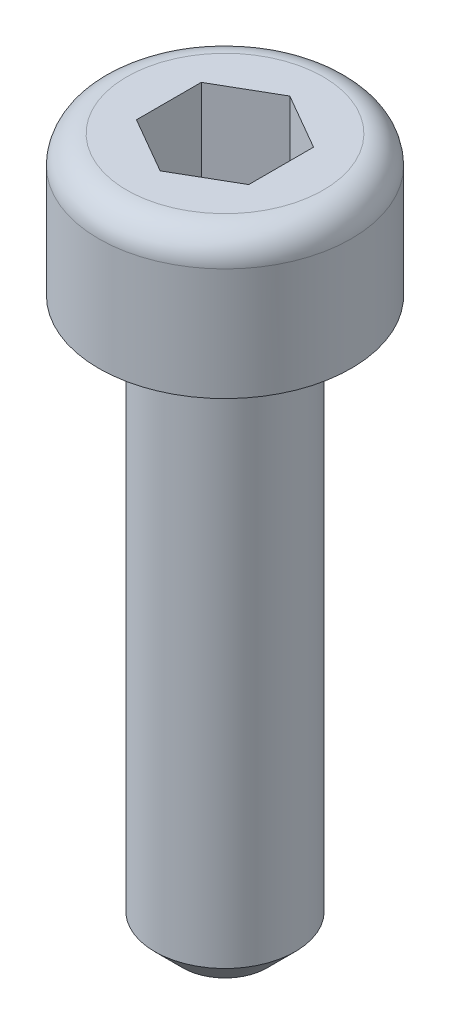
ISO-10303-21;
HEADER;
FILE_DESCRIPTION(('STEP AP214'),'2;1');
FILE_NAME('part.step','',(''),(''),'','','');
FILE_SCHEMA(('AUTOMOTIVE_DESIGN { 1 0 10303 214 1 1 1 1 }'));
ENDSEC;
DATA;
#1=APPLICATION_CONTEXT('core data for automotive mechanical design processes');
#2=APPLICATION_PROTOCOL_DEFINITION('international standard','automotive_design',2000,#1);
#3=PRODUCT_CONTEXT('',#1,'mechanical');
#4=PRODUCT('Part','Part','',(#3));
#5=PRODUCT_RELATED_PRODUCT_CATEGORY('part','',(#4));
#6=PRODUCT_DEFINITION_FORMATION('','',#4);
#7=PRODUCT_DEFINITION_CONTEXT('part definition',#1,'design');
#8=PRODUCT_DEFINITION('design','',#6,#7);
#9=PRODUCT_DEFINITION_SHAPE('','',#8);
#10=(LENGTH_UNIT() NAMED_UNIT(*) SI_UNIT(.MILLI.,.METRE.));
#11=(NAMED_UNIT(*) PLANE_ANGLE_UNIT() SI_UNIT($,.RADIAN.));
#12=(NAMED_UNIT(*) SI_UNIT($,.STERADIAN.) SOLID_ANGLE_UNIT());
#13=UNCERTAINTY_MEASURE_WITH_UNIT(LENGTH_MEASURE(1.E-05),#10,'distance_accuracy_value','');
#14=(GEOMETRIC_REPRESENTATION_CONTEXT(3) GLOBAL_UNCERTAINTY_ASSIGNED_CONTEXT((#13)) GLOBAL_UNIT_ASSIGNED_CONTEXT((#10,
#11,#12)) REPRESENTATION_CONTEXT('',''));
#15=CARTESIAN_POINT('',(0.,0.,0.));
#16=DIRECTION('',(0.,0.,1.));
#17=DIRECTION('',(1.,0.,0.));
#18=AXIS2_PLACEMENT_3D('',#15,#16,#17);
#19=CARTESIAN_POINT('',(0.,0.,0.));
#20=DIRECTION('',(0.,-1.,0.));
#21=DIRECTION('',(0.,0.,-1.));
#22=AXIS2_PLACEMENT_3D('',#19,#20,#21);
#23=PLANE('',#22);
#24=CARTESIAN_POINT('',(0.,0.,0.));
#25=DIRECTION('',(0.,-1.,0.));
#26=DIRECTION('',(0.,0.,-1.));
#27=AXIS2_PLACEMENT_3D('',#24,#25,#26);
#28=CIRCLE('',#27,1.75);
#29=CARTESIAN_POINT('',(0.,0.,-1.75));
#30=VERTEX_POINT('',#29);
#31=EDGE_CURVE('E42',#30,#30,#28,.F.);
#32=ORIENTED_EDGE('',*,*,#31,.T.);
#33=EDGE_LOOP('',(#32));
#34=FACE_BOUND('',#33,.T.);
#35=DIRECTION('',(-0.866025403784439,0.,-0.5));
#36=VECTOR('',#35,1.);
#37=CARTESIAN_POINT('',(1.,0.,-0.577350269189626));
#38=LINE('',#37,#36);
#39=CARTESIAN_POINT('',(1.,0.,-0.577350269189626));
#40=VERTEX_POINT('',#39);
#41=CARTESIAN_POINT('',(0.,0.,-1.15470053837925));
#42=VERTEX_POINT('',#41);
#43=EDGE_CURVE('E123',#40,#42,#38,.T.);
#44=ORIENTED_EDGE('',*,*,#43,.F.);
#45=DIRECTION('',(0.,0.,-1.));
#46=VECTOR('',#45,1.);
#47=CARTESIAN_POINT('',(1.,0.,0.577350269189626));
#48=LINE('',#47,#46);
#49=CARTESIAN_POINT('',(1.,0.,0.577350269189626));
#50=VERTEX_POINT('',#49);
#51=EDGE_CURVE('E49',#50,#40,#48,.T.);
#52=ORIENTED_EDGE('',*,*,#51,.F.);
#53=DIRECTION('',(0.866025403784439,0.,-0.5));
#54=VECTOR('',#53,1.);
#55=CARTESIAN_POINT('',(0.,0.,1.15470053837925));
#56=LINE('',#55,#54);
#57=CARTESIAN_POINT('',(0.,0.,1.15470053837925));
#58=VERTEX_POINT('',#57);
#59=EDGE_CURVE('E132',#58,#50,#56,.T.);
#60=ORIENTED_EDGE('',*,*,#59,.F.);
#61=DIRECTION('',(0.866025403784438,0.,0.5));
#62=VECTOR('',#61,1.);
#63=CARTESIAN_POINT('',(-0.999999999999999,0.,0.577350269189626));
#64=LINE('',#63,#62);
#65=CARTESIAN_POINT('',(-0.999999999999999,0.,0.577350269189626));
#66=VERTEX_POINT('',#65);
#67=EDGE_CURVE('E130',#66,#58,#64,.T.);
#68=ORIENTED_EDGE('',*,*,#67,.F.);
#69=DIRECTION('',(0.,0.,1.));
#70=VECTOR('',#69,1.);
#71=CARTESIAN_POINT('',(-0.999999999999999,0.,-0.577350269189626));
#72=LINE('',#71,#70);
#73=CARTESIAN_POINT('',(-0.999999999999999,0.,-0.577350269189626));
#74=VERTEX_POINT('',#73);
#75=EDGE_CURVE('E97',#74,#66,#72,.T.);
#76=ORIENTED_EDGE('',*,*,#75,.F.);
#77=DIRECTION('',(-0.866025403784439,0.,0.5));
#78=VECTOR('',#77,1.);
#79=CARTESIAN_POINT('',(0.,0.,-1.15470053837925));
#80=LINE('',#79,#78);
#81=EDGE_CURVE('E126',#42,#74,#80,.T.);
#82=ORIENTED_EDGE('',*,*,#81,.F.);
#83=EDGE_LOOP('',(#44,#52,#60,#68,#76,#82));
#84=FACE_BOUND('',#83,.T.);
#85=ADVANCED_FACE('F34',(#34,#84),#23,.F.);
#86=CARTESIAN_POINT('',(0.,0.,0.));
#87=DIRECTION('',(0.,1.,0.));
#88=DIRECTION('',(0.,0.,1.));
#89=AXIS2_PLACEMENT_3D('',#86,#87,#88);
#90=CYLINDRICAL_SURFACE('',#89,2.25);
#91=CARTESIAN_POINT('',(0.,-0.5,0.));
#92=DIRECTION('',(0.,-1.,0.));
#93=DIRECTION('',(0.,0.,-1.));
#94=AXIS2_PLACEMENT_3D('',#91,#92,#93);
#95=CIRCLE('',#94,2.25);
#96=CARTESIAN_POINT('',(0.,-0.5,-2.25));
#97=VERTEX_POINT('',#96);
#98=EDGE_CURVE('E11',#97,#97,#95,.T.);
#99=ORIENTED_EDGE('',*,*,#98,.T.);
#100=EDGE_LOOP('',(#99));
#101=FACE_BOUND('',#100,.T.);
#102=CARTESIAN_POINT('',(0.,-2.5,0.));
#103=DIRECTION('',(0.,1.,0.));
#104=DIRECTION('',(0.,0.,1.));
#105=AXIS2_PLACEMENT_3D('',#102,#103,#104);
#106=CIRCLE('',#105,2.25);
#107=CARTESIAN_POINT('',(0.,-2.5,2.25));
#108=VERTEX_POINT('',#107);
#109=EDGE_CURVE('E144',#108,#108,#106,.T.);
#110=ORIENTED_EDGE('',*,*,#109,.T.);
#111=EDGE_LOOP('',(#110));
#112=FACE_BOUND('',#111,.T.);
#113=ADVANCED_FACE('F166',(#101,#112),#90,.T.);
#114=CARTESIAN_POINT('',(2.25,-2.5,0.));
#115=DIRECTION('',(0.,1.,0.));
#116=DIRECTION('',(0.,0.,1.));
#117=AXIS2_PLACEMENT_3D('',#114,#115,#116);
#118=PLANE('',#117);
#119=ORIENTED_EDGE('',*,*,#109,.F.);
#120=EDGE_LOOP('',(#119));
#121=FACE_BOUND('',#120,.T.);
#122=CARTESIAN_POINT('',(0.,-2.5,0.));
#123=DIRECTION('',(0.,1.,0.));
#124=DIRECTION('',(0.,0.,1.));
#125=AXIS2_PLACEMENT_3D('',#122,#123,#124);
#126=CIRCLE('',#125,1.25);
#127=CARTESIAN_POINT('',(0.,-2.5,1.25));
#128=VERTEX_POINT('',#127);
#129=EDGE_CURVE('E136',#128,#128,#126,.T.);
#130=ORIENTED_EDGE('',*,*,#129,.T.);
#131=EDGE_LOOP('',(#130));
#132=FACE_BOUND('',#131,.T.);
#133=ADVANCED_FACE('F171',(#121,#132),#118,.F.);
#134=CARTESIAN_POINT('',(0.,0.,0.));
#135=DIRECTION('',(0.,1.,0.));
#136=DIRECTION('',(0.,0.,1.));
#137=AXIS2_PLACEMENT_3D('',#134,#135,#136);
#138=CYLINDRICAL_SURFACE('',#137,1.25);
#139=CARTESIAN_POINT('',(0.,-12.,0.));
#140=DIRECTION('',(0.,1.,0.));
#141=DIRECTION('',(0.,0.,1.));
#142=AXIS2_PLACEMENT_3D('',#139,#140,#141);
#143=CIRCLE('',#142,1.25);
#144=CARTESIAN_POINT('',(0.,-12.,1.25));
#145=VERTEX_POINT('',#144);
#146=EDGE_CURVE('E147',#145,#145,#143,.T.);
#147=ORIENTED_EDGE('',*,*,#146,.T.);
#148=EDGE_LOOP('',(#147));
#149=FACE_BOUND('',#148,.T.);
#150=ORIENTED_EDGE('',*,*,#129,.F.);
#151=EDGE_LOOP('',(#150));
#152=FACE_BOUND('',#151,.T.);
#153=ADVANCED_FACE('F177',(#149,#152),#138,.T.);
#154=CARTESIAN_POINT('',(1.25,-12.5,0.));
#155=DIRECTION('',(0.,1.,0.));
#156=DIRECTION('',(0.,0.,1.));
#157=AXIS2_PLACEMENT_3D('',#154,#155,#156);
#158=PLANE('',#157);
#159=CARTESIAN_POINT('',(0.,-12.5,0.));
#160=DIRECTION('',(0.,1.,0.));
#161=DIRECTION('',(0.,0.,1.));
#162=AXIS2_PLACEMENT_3D('',#159,#160,#161);
#163=CIRCLE('',#162,0.750000000000002);
#164=CARTESIAN_POINT('',(0.,-12.5,0.750000000000002));
#165=VERTEX_POINT('',#164);
#166=EDGE_CURVE('E150',#165,#165,#163,.F.);
#167=ORIENTED_EDGE('',*,*,#166,.T.);
#168=EDGE_LOOP('',(#167));
#169=FACE_BOUND('',#168,.T.);
#170=ADVANCED_FACE('F181',(#169),#158,.F.);
#171=CARTESIAN_POINT('',(1.,-2.,0.577350269189626));
#172=DIRECTION('',(1.,0.,0.));
#173=DIRECTION('',(0.,0.,-1.));
#174=AXIS2_PLACEMENT_3D('',#171,#172,#173);
#175=PLANE('',#174);
#176=ORIENTED_EDGE('',*,*,#51,.T.);
#177=DIRECTION('',(0.,1.,0.));
#178=VECTOR('',#177,1.);
#179=CARTESIAN_POINT('',(1.,-2.,-0.577350269189626));
#180=LINE('',#179,#178);
#181=CARTESIAN_POINT('',(1.,-2.,-0.577350269189626));
#182=VERTEX_POINT('',#181);
#183=EDGE_CURVE('E79',#182,#40,#180,.T.);
#184=ORIENTED_EDGE('',*,*,#183,.F.);
#185=DIRECTION('',(0.,0.,-1.));
#186=VECTOR('',#185,1.);
#187=CARTESIAN_POINT('',(1.,-2.,0.577350269189626));
#188=LINE('',#187,#186);
#189=CARTESIAN_POINT('',(1.,-2.,0.577350269189626));
#190=VERTEX_POINT('',#189);
#191=EDGE_CURVE('E134',#190,#182,#188,.T.);
#192=ORIENTED_EDGE('',*,*,#191,.F.);
#193=DIRECTION('',(0.,1.,0.));
#194=VECTOR('',#193,1.);
#195=CARTESIAN_POINT('',(1.,-2.,0.577350269189626));
#196=LINE('',#195,#194);
#197=EDGE_CURVE('E57',#190,#50,#196,.T.);
#198=ORIENTED_EDGE('',*,*,#197,.T.);
#199=EDGE_LOOP('',(#176,#184,#192,#198));
#200=FACE_BOUND('',#199,.T.);
#201=ADVANCED_FACE('F185',(#200),#175,.F.);
#202=CARTESIAN_POINT('',(0.,-2.,1.15470053837925));
#203=DIRECTION('',(0.5,0.,0.866025403784439));
#204=DIRECTION('',(0.866025403784439,0.,-0.5));
#205=AXIS2_PLACEMENT_3D('',#202,#203,#204);
#206=PLANE('',#205);
#207=ORIENTED_EDGE('',*,*,#59,.T.);
#208=ORIENTED_EDGE('',*,*,#197,.F.);
#209=DIRECTION('',(0.866025403784439,0.,-0.5));
#210=VECTOR('',#209,1.);
#211=CARTESIAN_POINT('',(0.,-2.,1.15470053837925));
#212=LINE('',#211,#210);
#213=CARTESIAN_POINT('',(0.,-2.,1.15470053837925));
#214=VERTEX_POINT('',#213);
#215=EDGE_CURVE('E109',#214,#190,#212,.T.);
#216=ORIENTED_EDGE('',*,*,#215,.F.);
#217=DIRECTION('',(0.,1.,0.));
#218=VECTOR('',#217,1.);
#219=CARTESIAN_POINT('',(0.,-2.,1.15470053837925));
#220=LINE('',#219,#218);
#221=EDGE_CURVE('E101',#214,#58,#220,.T.);
#222=ORIENTED_EDGE('',*,*,#221,.T.);
#223=EDGE_LOOP('',(#207,#208,#216,#222));
#224=FACE_BOUND('',#223,.T.);
#225=ADVANCED_FACE('F189',(#224),#206,.F.);
#226=CARTESIAN_POINT('',(-0.999999999999999,-2.,0.577350269189626));
#227=DIRECTION('',(-0.5,0.,0.866025403784439));
#228=DIRECTION('',(0.866025403784438,0.,0.5));
#229=AXIS2_PLACEMENT_3D('',#226,#227,#228);
#230=PLANE('',#229);
#231=ORIENTED_EDGE('',*,*,#67,.T.);
#232=ORIENTED_EDGE('',*,*,#221,.F.);
#233=DIRECTION('',(0.866025403784438,0.,0.5));
#234=VECTOR('',#233,1.);
#235=CARTESIAN_POINT('',(-0.999999999999999,-2.,0.577350269189626));
#236=LINE('',#235,#234);
#237=CARTESIAN_POINT('',(-0.999999999999999,-2.,0.577350269189626));
#238=VERTEX_POINT('',#237);
#239=EDGE_CURVE('E105',#238,#214,#236,.T.);
#240=ORIENTED_EDGE('',*,*,#239,.F.);
#241=DIRECTION('',(0.,1.,0.));
#242=VECTOR('',#241,1.);
#243=CARTESIAN_POINT('',(-0.999999999999999,-2.,0.577350269189626));
#244=LINE('',#243,#242);
#245=EDGE_CURVE('E90',#238,#66,#244,.T.);
#246=ORIENTED_EDGE('',*,*,#245,.T.);
#247=EDGE_LOOP('',(#231,#232,#240,#246));
#248=FACE_BOUND('',#247,.T.);
#249=ADVANCED_FACE('F106',(#248),#230,.F.);
#250=CARTESIAN_POINT('',(-0.999999999999999,-2.,-0.577350269189626));
#251=DIRECTION('',(-1.,0.,0.));
#252=DIRECTION('',(0.,0.,1.));
#253=AXIS2_PLACEMENT_3D('',#250,#251,#252);
#254=PLANE('',#253);
#255=ORIENTED_EDGE('',*,*,#75,.T.);
#256=ORIENTED_EDGE('',*,*,#245,.F.);
#257=DIRECTION('',(0.,0.,1.));
#258=VECTOR('',#257,1.);
#259=CARTESIAN_POINT('',(-0.999999999999999,-2.,-0.577350269189626));
#260=LINE('',#259,#258);
#261=CARTESIAN_POINT('',(-0.999999999999999,-2.,-0.577350269189626));
#262=VERTEX_POINT('',#261);
#263=EDGE_CURVE('E94',#262,#238,#260,.T.);
#264=ORIENTED_EDGE('',*,*,#263,.F.);
#265=DIRECTION('',(0.,1.,0.));
#266=VECTOR('',#265,1.);
#267=CARTESIAN_POINT('',(-0.999999999999999,-2.,-0.577350269189626));
#268=LINE('',#267,#266);
#269=EDGE_CURVE('E102',#262,#74,#268,.T.);
#270=ORIENTED_EDGE('',*,*,#269,.T.);
#271=EDGE_LOOP('',(#255,#256,#264,#270));
#272=FACE_BOUND('',#271,.T.);
#273=ADVANCED_FACE('F92',(#272),#254,.F.);
#274=CARTESIAN_POINT('',(0.,-2.,-1.15470053837925));
#275=DIRECTION('',(-0.5,0.,-0.866025403784439));
#276=DIRECTION('',(-0.866025403784439,0.,0.5));
#277=AXIS2_PLACEMENT_3D('',#274,#275,#276);
#278=PLANE('',#277);
#279=ORIENTED_EDGE('',*,*,#81,.T.);
#280=ORIENTED_EDGE('',*,*,#269,.F.);
#281=DIRECTION('',(-0.866025403784439,0.,0.5));
#282=VECTOR('',#281,1.);
#283=CARTESIAN_POINT('',(0.,-2.,-1.15470053837925));
#284=LINE('',#283,#282);
#285=CARTESIAN_POINT('',(0.,-2.,-1.15470053837925));
#286=VERTEX_POINT('',#285);
#287=EDGE_CURVE('E115',#286,#262,#284,.T.);
#288=ORIENTED_EDGE('',*,*,#287,.F.);
#289=DIRECTION('',(0.,1.,0.));
#290=VECTOR('',#289,1.);
#291=CARTESIAN_POINT('',(0.,-2.,-1.15470053837925));
#292=LINE('',#291,#290);
#293=EDGE_CURVE('E139',#286,#42,#292,.T.);
#294=ORIENTED_EDGE('',*,*,#293,.T.);
#295=EDGE_LOOP('',(#279,#280,#288,#294));
#296=FACE_BOUND('',#295,.T.);
#297=ADVANCED_FACE('F193',(#296),#278,.F.);
#298=CARTESIAN_POINT('',(1.,-2.,-0.577350269189626));
#299=DIRECTION('',(0.5,0.,-0.866025403784439));
#300=DIRECTION('',(-0.866025403784439,0.,-0.5));
#301=AXIS2_PLACEMENT_3D('',#298,#299,#300);
#302=PLANE('',#301);
#303=ORIENTED_EDGE('',*,*,#43,.T.);
#304=ORIENTED_EDGE('',*,*,#293,.F.);
#305=DIRECTION('',(-0.866025403784439,0.,-0.5));
#306=VECTOR('',#305,1.);
#307=CARTESIAN_POINT('',(1.,-2.,-0.577350269189626));
#308=LINE('',#307,#306);
#309=EDGE_CURVE('E117',#182,#286,#308,.T.);
#310=ORIENTED_EDGE('',*,*,#309,.F.);
#311=ORIENTED_EDGE('',*,*,#183,.T.);
#312=EDGE_LOOP('',(#303,#304,#310,#311));
#313=FACE_BOUND('',#312,.T.);
#314=ADVANCED_FACE('F190',(#313),#302,.F.);
#315=CARTESIAN_POINT('',(1.,-2.,-0.577350269189626));
#316=DIRECTION('',(0.,1.,0.));
#317=DIRECTION('',(0.,0.,1.));
#318=AXIS2_PLACEMENT_3D('',#315,#316,#317);
#319=PLANE('',#318);
#320=ORIENTED_EDGE('',*,*,#191,.T.);
#321=ORIENTED_EDGE('',*,*,#309,.T.);
#322=ORIENTED_EDGE('',*,*,#287,.T.);
#323=ORIENTED_EDGE('',*,*,#263,.T.);
#324=ORIENTED_EDGE('',*,*,#239,.T.);
#325=ORIENTED_EDGE('',*,*,#215,.T.);
#326=EDGE_LOOP('',(#320,#321,#322,#323,#324,#325));
#327=FACE_BOUND('',#326,.T.);
#328=ADVANCED_FACE('F112',(#327),#319,.T.);
#329=CARTESIAN_POINT('',(0.,-12.,0.));
#330=DIRECTION('',(0.,1.,0.));
#331=DIRECTION('',(0.,0.,1.));
#332=AXIS2_PLACEMENT_3D('',#329,#330,#331);
#333=CONICAL_SURFACE('',#332,1.25,0.78539816339745);
#334=ORIENTED_EDGE('',*,*,#166,.F.);
#335=EDGE_LOOP('',(#334));
#336=FACE_BOUND('',#335,.T.);
#337=ORIENTED_EDGE('',*,*,#146,.F.);
#338=EDGE_LOOP('',(#337));
#339=FACE_BOUND('',#338,.T.);
#340=ADVANCED_FACE('F158',(#336,#339),#333,.T.);
#341=CARTESIAN_POINT('',(0.,-0.5,0.));
#342=DIRECTION('',(0.,-1.,0.));
#343=DIRECTION('',(0.,0.,-1.));
#344=AXIS2_PLACEMENT_3D('',#341,#342,#343);
#345=TOROIDAL_SURFACE('',#344,1.75,0.5);
#346=ORIENTED_EDGE('',*,*,#98,.F.);
#347=EDGE_LOOP('',(#346));
#348=FACE_BOUND('',#347,.T.);
#349=ORIENTED_EDGE('',*,*,#31,.F.);
#350=EDGE_LOOP('',(#349));
#351=FACE_BOUND('',#350,.T.);
#352=ADVANCED_FACE('F36',(#348,#351),#345,.T.);
#353=CLOSED_SHELL('',(#85,#113,#133,#153,#170,#201,#225,#249,#273,#297,#314,#328,#340,#352));
#354=MANIFOLD_SOLID_BREP('B2',#353);
#355=ADVANCED_BREP_SHAPE_REPRESENTATION('',(#18,#354),#14);
#356=SHAPE_DEFINITION_REPRESENTATION(#9,#355);
ENDSEC;
END-ISO-10303-21;
